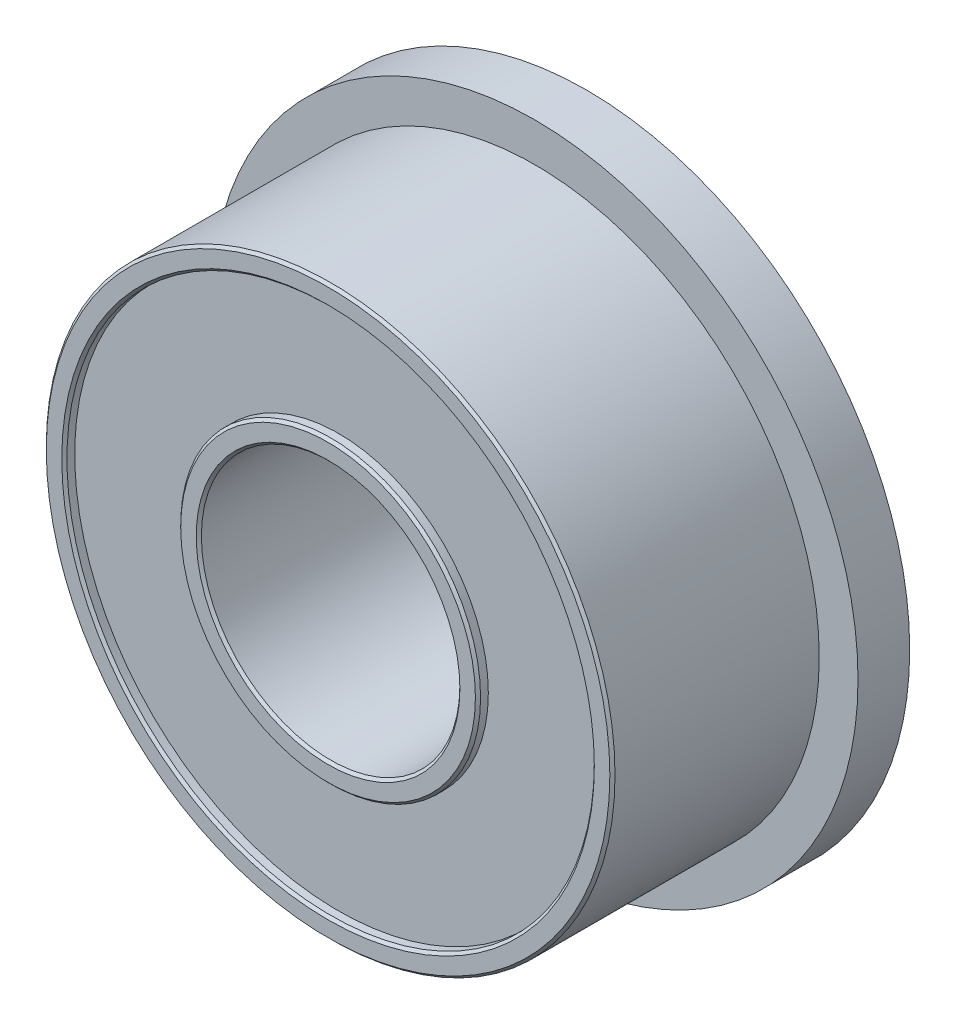
ISO-10303-21;
HEADER;
FILE_DESCRIPTION(('STEP AP214'),'2;1');
FILE_NAME('part.step','',(''),(''),'','','');
FILE_SCHEMA(('AUTOMOTIVE_DESIGN { 1 0 10303 214 1 1 1 1 }'));
ENDSEC;
DATA;
#1=APPLICATION_CONTEXT('core data for automotive mechanical design processes');
#2=APPLICATION_PROTOCOL_DEFINITION('international standard','automotive_design',2000,#1);
#3=PRODUCT_CONTEXT('',#1,'mechanical');
#4=PRODUCT('Part','Part','',(#3));
#5=PRODUCT_RELATED_PRODUCT_CATEGORY('part','',(#4));
#6=PRODUCT_DEFINITION_FORMATION('','',#4);
#7=PRODUCT_DEFINITION_CONTEXT('part definition',#1,'design');
#8=PRODUCT_DEFINITION('design','',#6,#7);
#9=PRODUCT_DEFINITION_SHAPE('','',#8);
#10=(LENGTH_UNIT() NAMED_UNIT(*) SI_UNIT(.MILLI.,.METRE.));
#11=(NAMED_UNIT(*) PLANE_ANGLE_UNIT() SI_UNIT($,.RADIAN.));
#12=(NAMED_UNIT(*) SI_UNIT($,.STERADIAN.) SOLID_ANGLE_UNIT());
#13=UNCERTAINTY_MEASURE_WITH_UNIT(LENGTH_MEASURE(1.E-05),#10,'distance_accuracy_value','');
#14=(GEOMETRIC_REPRESENTATION_CONTEXT(3) GLOBAL_UNCERTAINTY_ASSIGNED_CONTEXT((#13)) GLOBAL_UNIT_ASSIGNED_CONTEXT((#10,
#11,#12)) REPRESENTATION_CONTEXT('',''));
#15=CARTESIAN_POINT('',(0.,0.,0.));
#16=DIRECTION('',(0.,0.,1.));
#17=DIRECTION('',(1.,0.,0.));
#18=AXIS2_PLACEMENT_3D('',#15,#16,#17);
#19=CARTESIAN_POINT('',(0.,0.,-2.5));
#20=DIRECTION('',(0.,0.,1.));
#21=DIRECTION('',(1.,0.,0.));
#22=AXIS2_PLACEMENT_3D('',#19,#20,#21);
#23=PLANE('',#22);
#24=CARTESIAN_POINT('',(0.,0.,-2.5));
#25=DIRECTION('',(0.,0.,1.));
#26=DIRECTION('',(1.,0.,0.));
#27=AXIS2_PLACEMENT_3D('',#24,#25,#26);
#28=CIRCLE('',#27,5.15);
#29=CARTESIAN_POINT('',(5.15,0.,-2.5));
#30=VERTEX_POINT('',#29);
#31=EDGE_CURVE('E38',#30,#30,#28,.T.);
#32=ORIENTED_EDGE('',*,*,#31,.T.);
#33=EDGE_LOOP('',(#32));
#34=FACE_BOUND('',#33,.T.);
#35=CARTESIAN_POINT('',(0.,0.,-2.5));
#36=DIRECTION('',(0.,0.,-1.));
#37=DIRECTION('',(-1.,0.,0.));
#38=AXIS2_PLACEMENT_3D('',#35,#36,#37);
#39=CIRCLE('',#38,6.25);
#40=CARTESIAN_POINT('',(-6.25,0.,-2.5));
#41=VERTEX_POINT('',#40);
#42=EDGE_CURVE('E85',#41,#41,#39,.T.);
#43=ORIENTED_EDGE('',*,*,#42,.T.);
#44=EDGE_LOOP('',(#43));
#45=FACE_BOUND('',#44,.T.);
#46=ADVANCED_FACE('F31',(#34,#45),#23,.F.);
#47=CARTESIAN_POINT('',(0.,0.,2.5));
#48=DIRECTION('',(0.,0.,1.));
#49=DIRECTION('',(1.,0.,0.));
#50=AXIS2_PLACEMENT_3D('',#47,#48,#49);
#51=PLANE('',#50);
#52=CARTESIAN_POINT('',(0.,0.,2.5));
#53=DIRECTION('',(0.,0.,1.));
#54=DIRECTION('',(1.,0.,0.));
#55=AXIS2_PLACEMENT_3D('',#52,#53,#54);
#56=CIRCLE('',#55,2.85);
#57=CARTESIAN_POINT('',(2.85,0.,2.5));
#58=VERTEX_POINT('',#57);
#59=EDGE_CURVE('E60',#58,#58,#56,.T.);
#60=ORIENTED_EDGE('',*,*,#59,.T.);
#61=EDGE_LOOP('',(#60));
#62=FACE_BOUND('',#61,.T.);
#63=CARTESIAN_POINT('',(0.,0.,2.5));
#64=DIRECTION('',(0.,0.,1.));
#65=DIRECTION('',(1.,0.,0.));
#66=AXIS2_PLACEMENT_3D('',#63,#64,#65);
#67=CIRCLE('',#66,2.55);
#68=CARTESIAN_POINT('',(2.55,0.,2.5));
#69=VERTEX_POINT('',#68);
#70=EDGE_CURVE('E63',#69,#69,#67,.F.);
#71=ORIENTED_EDGE('',*,*,#70,.T.);
#72=EDGE_LOOP('',(#71));
#73=FACE_BOUND('',#72,.T.);
#74=ADVANCED_FACE('F121',(#62,#73),#51,.T.);
#75=CARTESIAN_POINT('',(0.,0.,2.5));
#76=DIRECTION('',(0.,0.,-1.));
#77=DIRECTION('',(-1.,0.,0.));
#78=AXIS2_PLACEMENT_3D('',#75,#76,#77);
#79=CYLINDRICAL_SURFACE('',#78,5.5);
#80=CARTESIAN_POINT('',(0.,0.,2.45));
#81=DIRECTION('',(0.,0.,1.));
#82=DIRECTION('',(1.,0.,0.));
#83=AXIS2_PLACEMENT_3D('',#80,#81,#82);
#84=CIRCLE('',#83,5.5);
#85=CARTESIAN_POINT('',(5.5,0.,2.45));
#86=VERTEX_POINT('',#85);
#87=EDGE_CURVE('E46',#86,#86,#84,.F.);
#88=ORIENTED_EDGE('',*,*,#87,.T.);
#89=EDGE_LOOP('',(#88));
#90=FACE_BOUND('',#89,.T.);
#91=CARTESIAN_POINT('',(0.,0.,-1.5));
#92=DIRECTION('',(0.,0.,-1.));
#93=DIRECTION('',(-1.,0.,0.));
#94=AXIS2_PLACEMENT_3D('',#91,#92,#93);
#95=CIRCLE('',#94,5.5);
#96=CARTESIAN_POINT('',(-5.5,0.,-1.5));
#97=VERTEX_POINT('',#96);
#98=EDGE_CURVE('E81',#97,#97,#95,.T.);
#99=ORIENTED_EDGE('',*,*,#98,.F.);
#100=EDGE_LOOP('',(#99));
#101=FACE_BOUND('',#100,.T.);
#102=ADVANCED_FACE('F127',(#90,#101),#79,.T.);
#103=CARTESIAN_POINT('',(0.,0.,2.5));
#104=DIRECTION('',(0.,0.,1.));
#105=DIRECTION('',(1.,0.,0.));
#106=AXIS2_PLACEMENT_3D('',#103,#104,#105);
#107=CIRCLE('',#106,5.44999999999999);
#108=CARTESIAN_POINT('',(5.44999999999999,0.,2.5));
#109=VERTEX_POINT('',#108);
#110=EDGE_CURVE('E51',#109,#109,#107,.T.);
#111=ORIENTED_EDGE('',*,*,#110,.T.);
#112=EDGE_LOOP('',(#111));
#113=FACE_BOUND('',#112,.T.);
#114=CARTESIAN_POINT('',(0.,0.,2.5));
#115=DIRECTION('',(0.,0.,1.));
#116=DIRECTION('',(1.,0.,0.));
#117=AXIS2_PLACEMENT_3D('',#114,#115,#116);
#118=CIRCLE('',#117,5.15);
#119=CARTESIAN_POINT('',(5.15,0.,2.5));
#120=VERTEX_POINT('',#119);
#121=EDGE_CURVE('E54',#120,#120,#118,.F.);
#122=ORIENTED_EDGE('',*,*,#121,.T.);
#123=EDGE_LOOP('',(#122));
#124=FACE_BOUND('',#123,.T.);
#125=ADVANCED_FACE('F130',(#113,#124),#51,.T.);
#126=CARTESIAN_POINT('',(0.,0.,-2.5));
#127=DIRECTION('',(0.,0.,1.));
#128=DIRECTION('',(1.,0.,0.));
#129=AXIS2_PLACEMENT_3D('',#126,#127,#128);
#130=CIRCLE('',#129,2.55);
#131=CARTESIAN_POINT('',(2.55,0.,-2.5));
#132=VERTEX_POINT('',#131);
#133=EDGE_CURVE('E75',#132,#132,#130,.T.);
#134=ORIENTED_EDGE('',*,*,#133,.T.);
#135=EDGE_LOOP('',(#134));
#136=FACE_BOUND('',#135,.T.);
#137=CARTESIAN_POINT('',(0.,0.,-2.5));
#138=DIRECTION('',(0.,0.,1.));
#139=DIRECTION('',(1.,0.,0.));
#140=AXIS2_PLACEMENT_3D('',#137,#138,#139);
#141=CIRCLE('',#140,2.85);
#142=CARTESIAN_POINT('',(2.85,0.,-2.5));
#143=VERTEX_POINT('',#142);
#144=EDGE_CURVE('E78',#143,#143,#141,.F.);
#145=ORIENTED_EDGE('',*,*,#144,.T.);
#146=EDGE_LOOP('',(#145));
#147=FACE_BOUND('',#146,.T.);
#148=ADVANCED_FACE('F123',(#136,#147),#23,.F.);
#149=CARTESIAN_POINT('',(0.,0.,2.5));
#150=DIRECTION('',(0.,0.,-1.));
#151=DIRECTION('',(-1.,0.,0.));
#152=AXIS2_PLACEMENT_3D('',#149,#150,#151);
#153=CYLINDRICAL_SURFACE('',#152,2.5);
#154=CARTESIAN_POINT('',(0.,0.,-2.45));
#155=DIRECTION('',(0.,0.,1.));
#156=DIRECTION('',(1.,0.,0.));
#157=AXIS2_PLACEMENT_3D('',#154,#155,#156);
#158=CIRCLE('',#157,2.5);
#159=CARTESIAN_POINT('',(2.5,0.,-2.45));
#160=VERTEX_POINT('',#159);
#161=EDGE_CURVE('E69',#160,#160,#158,.F.);
#162=ORIENTED_EDGE('',*,*,#161,.T.);
#163=EDGE_LOOP('',(#162));
#164=FACE_BOUND('',#163,.T.);
#165=CARTESIAN_POINT('',(0.,0.,2.45));
#166=DIRECTION('',(0.,0.,1.));
#167=DIRECTION('',(1.,0.,0.));
#168=AXIS2_PLACEMENT_3D('',#165,#166,#167);
#169=CIRCLE('',#168,2.5);
#170=CARTESIAN_POINT('',(2.5,0.,2.45));
#171=VERTEX_POINT('',#170);
#172=EDGE_CURVE('E72',#171,#171,#169,.T.);
#173=ORIENTED_EDGE('',*,*,#172,.T.);
#174=EDGE_LOOP('',(#173));
#175=FACE_BOUND('',#174,.T.);
#176=ADVANCED_FACE('F134',(#164,#175),#153,.F.);
#177=CARTESIAN_POINT('',(0.,0.,-1.5));
#178=DIRECTION('',(0.,0.,-1.));
#179=DIRECTION('',(-1.,0.,0.));
#180=AXIS2_PLACEMENT_3D('',#177,#178,#179);
#181=PLANE('',#180);
#182=CARTESIAN_POINT('',(0.,0.,-1.5));
#183=DIRECTION('',(0.,0.,-1.));
#184=DIRECTION('',(-1.,0.,0.));
#185=AXIS2_PLACEMENT_3D('',#182,#183,#184);
#186=CIRCLE('',#185,6.25);
#187=CARTESIAN_POINT('',(-6.25,0.,-1.5));
#188=VERTEX_POINT('',#187);
#189=EDGE_CURVE('E84',#188,#188,#186,.T.);
#190=ORIENTED_EDGE('',*,*,#189,.F.);
#191=EDGE_LOOP('',(#190));
#192=FACE_BOUND('',#191,.T.);
#193=ORIENTED_EDGE('',*,*,#98,.T.);
#194=EDGE_LOOP('',(#193));
#195=FACE_BOUND('',#194,.T.);
#196=ADVANCED_FACE('F140',(#192,#195),#181,.F.);
#197=CARTESIAN_POINT('',(0.,0.,-1.5));
#198=DIRECTION('',(0.,0.,-1.));
#199=DIRECTION('',(-1.,0.,0.));
#200=AXIS2_PLACEMENT_3D('',#197,#198,#199);
#201=CYLINDRICAL_SURFACE('',#200,6.25);
#202=ORIENTED_EDGE('',*,*,#189,.T.);
#203=EDGE_LOOP('',(#202));
#204=FACE_BOUND('',#203,.T.);
#205=ORIENTED_EDGE('',*,*,#42,.F.);
#206=EDGE_LOOP('',(#205));
#207=FACE_BOUND('',#206,.T.);
#208=ADVANCED_FACE('F181',(#204,#207),#201,.T.);
#209=CARTESIAN_POINT('',(0.,0.,2.3));
#210=DIRECTION('',(0.,0.,1.));
#211=DIRECTION('',(1.,0.,0.));
#212=AXIS2_PLACEMENT_3D('',#209,#210,#211);
#213=CYLINDRICAL_SURFACE('',#212,5.1);
#214=CARTESIAN_POINT('',(0.,0.,2.45));
#215=DIRECTION('',(0.,0.,1.));
#216=DIRECTION('',(1.,0.,0.));
#217=AXIS2_PLACEMENT_3D('',#214,#215,#216);
#218=CIRCLE('',#217,5.1);
#219=CARTESIAN_POINT('',(5.1,0.,2.45));
#220=VERTEX_POINT('',#219);
#221=EDGE_CURVE('E42',#220,#220,#218,.T.);
#222=ORIENTED_EDGE('',*,*,#221,.T.);
#223=EDGE_LOOP('',(#222));
#224=FACE_BOUND('',#223,.T.);
#225=CARTESIAN_POINT('',(0.,0.,2.3));
#226=DIRECTION('',(0.,0.,1.));
#227=DIRECTION('',(1.,0.,0.));
#228=AXIS2_PLACEMENT_3D('',#225,#226,#227);
#229=CIRCLE('',#228,5.1);
#230=CARTESIAN_POINT('',(5.1,0.,2.3));
#231=VERTEX_POINT('',#230);
#232=EDGE_CURVE('E88',#231,#231,#229,.T.);
#233=ORIENTED_EDGE('',*,*,#232,.F.);
#234=EDGE_LOOP('',(#233));
#235=FACE_BOUND('',#234,.T.);
#236=ADVANCED_FACE('F177',(#224,#235),#213,.F.);
#237=CARTESIAN_POINT('',(0.,0.,2.3));
#238=DIRECTION('',(0.,0.,1.));
#239=DIRECTION('',(1.,0.,0.));
#240=AXIS2_PLACEMENT_3D('',#237,#238,#239);
#241=PLANE('',#240);
#242=CARTESIAN_POINT('',(0.,0.,2.3));
#243=DIRECTION('',(0.,0.,1.));
#244=DIRECTION('',(1.,0.,0.));
#245=AXIS2_PLACEMENT_3D('',#242,#243,#244);
#246=CIRCLE('',#245,2.9);
#247=CARTESIAN_POINT('',(2.9,0.,2.3));
#248=VERTEX_POINT('',#247);
#249=EDGE_CURVE('E93',#248,#248,#246,.T.);
#250=ORIENTED_EDGE('',*,*,#249,.F.);
#251=EDGE_LOOP('',(#250));
#252=FACE_BOUND('',#251,.T.);
#253=ORIENTED_EDGE('',*,*,#232,.T.);
#254=EDGE_LOOP('',(#253));
#255=FACE_BOUND('',#254,.T.);
#256=ADVANCED_FACE('F180',(#252,#255),#241,.T.);
#257=CARTESIAN_POINT('',(0.,0.,2.3));
#258=DIRECTION('',(0.,0.,1.));
#259=DIRECTION('',(1.,0.,0.));
#260=AXIS2_PLACEMENT_3D('',#257,#258,#259);
#261=CYLINDRICAL_SURFACE('',#260,2.9);
#262=CARTESIAN_POINT('',(0.,0.,2.45));
#263=DIRECTION('',(0.,0.,1.));
#264=DIRECTION('',(1.,0.,0.));
#265=AXIS2_PLACEMENT_3D('',#262,#263,#264);
#266=CIRCLE('',#265,2.9);
#267=CARTESIAN_POINT('',(2.9,0.,2.45));
#268=VERTEX_POINT('',#267);
#269=EDGE_CURVE('E57',#268,#268,#266,.F.);
#270=ORIENTED_EDGE('',*,*,#269,.T.);
#271=EDGE_LOOP('',(#270));
#272=FACE_BOUND('',#271,.T.);
#273=ORIENTED_EDGE('',*,*,#249,.T.);
#274=EDGE_LOOP('',(#273));
#275=FACE_BOUND('',#274,.T.);
#276=ADVANCED_FACE('F186',(#272,#275),#261,.T.);
#277=CARTESIAN_POINT('',(0.,0.,-2.3));
#278=DIRECTION('',(0.,0.,-1.));
#279=DIRECTION('',(1.,0.,0.));
#280=AXIS2_PLACEMENT_3D('',#277,#278,#279);
#281=PLANE('',#280);
#282=CARTESIAN_POINT('',(0.,0.,-2.3));
#283=DIRECTION('',(0.,0.,1.));
#284=DIRECTION('',(1.,0.,0.));
#285=AXIS2_PLACEMENT_3D('',#282,#283,#284);
#286=CIRCLE('',#285,5.1);
#287=CARTESIAN_POINT('',(5.1,0.,-2.3));
#288=VERTEX_POINT('',#287);
#289=EDGE_CURVE('E96',#288,#288,#286,.T.);
#290=ORIENTED_EDGE('',*,*,#289,.F.);
#291=EDGE_LOOP('',(#290));
#292=FACE_BOUND('',#291,.T.);
#293=CARTESIAN_POINT('',(0.,0.,-2.3));
#294=DIRECTION('',(0.,0.,1.));
#295=DIRECTION('',(1.,0.,0.));
#296=AXIS2_PLACEMENT_3D('',#293,#294,#295);
#297=CIRCLE('',#296,2.9);
#298=CARTESIAN_POINT('',(2.9,0.,-2.3));
#299=VERTEX_POINT('',#298);
#300=EDGE_CURVE('E99',#299,#299,#297,.T.);
#301=ORIENTED_EDGE('',*,*,#300,.T.);
#302=EDGE_LOOP('',(#301));
#303=FACE_BOUND('',#302,.T.);
#304=ADVANCED_FACE('F103',(#292,#303),#281,.T.);
#305=CARTESIAN_POINT('',(0.,0.,-2.3));
#306=DIRECTION('',(0.,0.,-1.));
#307=DIRECTION('',(-1.,0.,0.));
#308=AXIS2_PLACEMENT_3D('',#305,#306,#307);
#309=CYLINDRICAL_SURFACE('',#308,5.1);
#310=CARTESIAN_POINT('',(0.,0.,-2.45));
#311=DIRECTION('',(0.,0.,1.));
#312=DIRECTION('',(1.,0.,0.));
#313=AXIS2_PLACEMENT_3D('',#310,#311,#312);
#314=CIRCLE('',#313,5.1);
#315=CARTESIAN_POINT('',(5.1,0.,-2.45));
#316=VERTEX_POINT('',#315);
#317=EDGE_CURVE('E10',#316,#316,#314,.F.);
#318=ORIENTED_EDGE('',*,*,#317,.T.);
#319=EDGE_LOOP('',(#318));
#320=FACE_BOUND('',#319,.T.);
#321=ORIENTED_EDGE('',*,*,#289,.T.);
#322=EDGE_LOOP('',(#321));
#323=FACE_BOUND('',#322,.T.);
#324=ADVANCED_FACE('F108',(#320,#323),#309,.F.);
#325=CARTESIAN_POINT('',(0.,0.,-2.3));
#326=DIRECTION('',(0.,0.,-1.));
#327=DIRECTION('',(-1.,0.,0.));
#328=AXIS2_PLACEMENT_3D('',#325,#326,#327);
#329=CYLINDRICAL_SURFACE('',#328,2.9);
#330=CARTESIAN_POINT('',(0.,0.,-2.45));
#331=DIRECTION('',(0.,0.,1.));
#332=DIRECTION('',(1.,0.,0.));
#333=AXIS2_PLACEMENT_3D('',#330,#331,#332);
#334=CIRCLE('',#333,2.9);
#335=CARTESIAN_POINT('',(2.9,0.,-2.45));
#336=VERTEX_POINT('',#335);
#337=EDGE_CURVE('E66',#336,#336,#334,.T.);
#338=ORIENTED_EDGE('',*,*,#337,.T.);
#339=EDGE_LOOP('',(#338));
#340=FACE_BOUND('',#339,.T.);
#341=ORIENTED_EDGE('',*,*,#300,.F.);
#342=EDGE_LOOP('',(#341));
#343=FACE_BOUND('',#342,.T.);
#344=ADVANCED_FACE('F105',(#340,#343),#329,.T.);
#345=CARTESIAN_POINT('',(0.,0.,-2.5));
#346=DIRECTION('',(0.,0.,-1.));
#347=DIRECTION('',(-1.,0.,0.));
#348=AXIS2_PLACEMENT_3D('',#345,#346,#347);
#349=CONICAL_SURFACE('',#348,2.55,0.785398163397461);
#350=ORIENTED_EDGE('',*,*,#161,.F.);
#351=EDGE_LOOP('',(#350));
#352=FACE_BOUND('',#351,.T.);
#353=ORIENTED_EDGE('',*,*,#133,.F.);
#354=EDGE_LOOP('',(#353));
#355=FACE_BOUND('',#354,.T.);
#356=ADVANCED_FACE('F107',(#352,#355),#349,.F.);
#357=CARTESIAN_POINT('',(0.,0.,-2.45));
#358=DIRECTION('',(0.,0.,1.));
#359=DIRECTION('',(1.,0.,0.));
#360=AXIS2_PLACEMENT_3D('',#357,#358,#359);
#361=CONICAL_SURFACE('',#360,2.9,0.785398163397453);
#362=ORIENTED_EDGE('',*,*,#144,.F.);
#363=EDGE_LOOP('',(#362));
#364=FACE_BOUND('',#363,.T.);
#365=ORIENTED_EDGE('',*,*,#337,.F.);
#366=EDGE_LOOP('',(#365));
#367=FACE_BOUND('',#366,.T.);
#368=ADVANCED_FACE('F115',(#364,#367),#361,.T.);
#369=CARTESIAN_POINT('',(0.,0.,2.5));
#370=DIRECTION('',(0.,0.,-1.));
#371=DIRECTION('',(-1.,0.,0.));
#372=AXIS2_PLACEMENT_3D('',#369,#370,#371);
#373=CONICAL_SURFACE('',#372,2.85,0.785398163397444);
#374=ORIENTED_EDGE('',*,*,#269,.F.);
#375=EDGE_LOOP('',(#374));
#376=FACE_BOUND('',#375,.T.);
#377=ORIENTED_EDGE('',*,*,#59,.F.);
#378=EDGE_LOOP('',(#377));
#379=FACE_BOUND('',#378,.T.);
#380=ADVANCED_FACE('F150',(#376,#379),#373,.T.);
#381=CARTESIAN_POINT('',(0.,0.,2.45));
#382=DIRECTION('',(0.,0.,1.));
#383=DIRECTION('',(1.,0.,0.));
#384=AXIS2_PLACEMENT_3D('',#381,#382,#383);
#385=CONICAL_SURFACE('',#384,2.5,0.785398163397448);
#386=ORIENTED_EDGE('',*,*,#70,.F.);
#387=EDGE_LOOP('',(#386));
#388=FACE_BOUND('',#387,.T.);
#389=ORIENTED_EDGE('',*,*,#172,.F.);
#390=EDGE_LOOP('',(#389));
#391=FACE_BOUND('',#390,.T.);
#392=ADVANCED_FACE('F156',(#388,#391),#385,.F.);
#393=CARTESIAN_POINT('',(0.,0.,2.5));
#394=DIRECTION('',(0.,0.,-1.));
#395=DIRECTION('',(-1.,0.,0.));
#396=AXIS2_PLACEMENT_3D('',#393,#394,#395);
#397=CONICAL_SURFACE('',#396,5.44999999999999,0.785398163397466);
#398=ORIENTED_EDGE('',*,*,#87,.F.);
#399=EDGE_LOOP('',(#398));
#400=FACE_BOUND('',#399,.T.);
#401=ORIENTED_EDGE('',*,*,#110,.F.);
#402=EDGE_LOOP('',(#401));
#403=FACE_BOUND('',#402,.T.);
#404=ADVANCED_FACE('F162',(#400,#403),#397,.T.);
#405=CARTESIAN_POINT('',(0.,0.,2.45));
#406=DIRECTION('',(0.,0.,1.));
#407=DIRECTION('',(1.,0.,0.));
#408=AXIS2_PLACEMENT_3D('',#405,#406,#407);
#409=CONICAL_SURFACE('',#408,5.1,0.785398163397457);
#410=ORIENTED_EDGE('',*,*,#121,.F.);
#411=EDGE_LOOP('',(#410));
#412=FACE_BOUND('',#411,.T.);
#413=ORIENTED_EDGE('',*,*,#221,.F.);
#414=EDGE_LOOP('',(#413));
#415=FACE_BOUND('',#414,.T.);
#416=ADVANCED_FACE('F165',(#412,#415),#409,.F.);
#417=CARTESIAN_POINT('',(0.,0.,-2.5));
#418=DIRECTION('',(0.,0.,-1.));
#419=DIRECTION('',(-1.,0.,0.));
#420=AXIS2_PLACEMENT_3D('',#417,#418,#419);
#421=CONICAL_SURFACE('',#420,5.15,0.785398163397466);
#422=ORIENTED_EDGE('',*,*,#317,.F.);
#423=EDGE_LOOP('',(#422));
#424=FACE_BOUND('',#423,.T.);
#425=ORIENTED_EDGE('',*,*,#31,.F.);
#426=EDGE_LOOP('',(#425));
#427=FACE_BOUND('',#426,.T.);
#428=ADVANCED_FACE('F33',(#424,#427),#421,.F.);
#429=CLOSED_SHELL('',(#46,#74,#102,#125,#148,#176,#196,#208,#236,#256,#276,#304,#324,#344,#356,
#368,#380,#392,#404,#416,#428));
#430=MANIFOLD_SOLID_BREP('B2',#429);
#431=ADVANCED_BREP_SHAPE_REPRESENTATION('',(#18,#430),#14);
#432=SHAPE_DEFINITION_REPRESENTATION(#9,#431);
ENDSEC;
END-ISO-10303-21;
